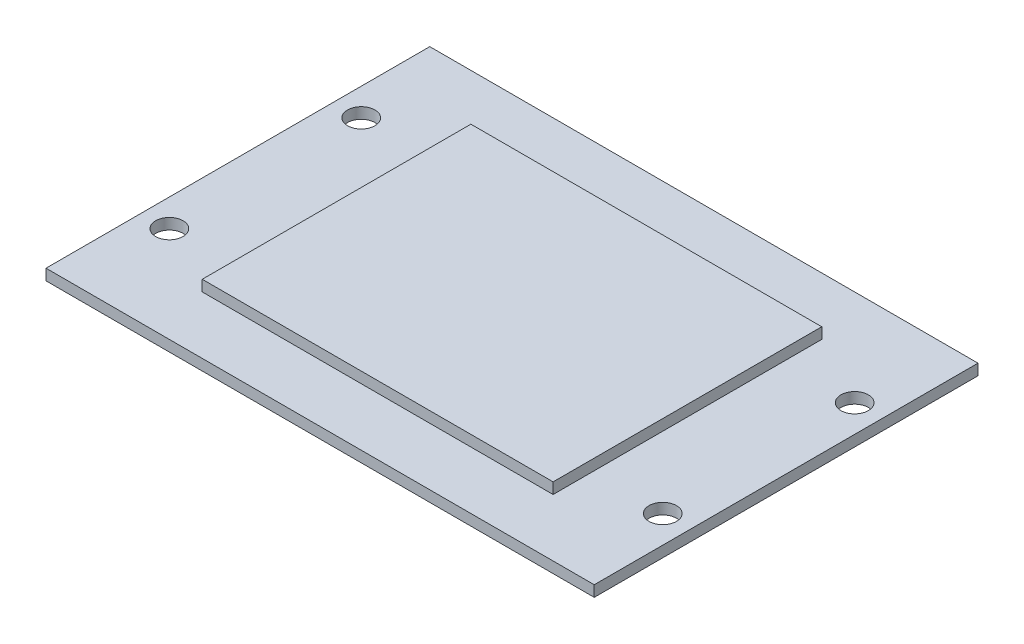
ISO-10303-21;
HEADER;
FILE_DESCRIPTION(('STEP AP214'),'2;1');
FILE_NAME('part.step','',(''),(''),'','','');
FILE_SCHEMA(('AUTOMOTIVE_DESIGN { 1 0 10303 214 1 1 1 1 }'));
ENDSEC;
DATA;
#1=APPLICATION_CONTEXT('core data for automotive mechanical design processes');
#2=APPLICATION_PROTOCOL_DEFINITION('international standard','automotive_design',2000,#1);
#3=PRODUCT_CONTEXT('',#1,'mechanical');
#4=PRODUCT('Part','Part','',(#3));
#5=PRODUCT_RELATED_PRODUCT_CATEGORY('part','',(#4));
#6=PRODUCT_DEFINITION_FORMATION('','',#4);
#7=PRODUCT_DEFINITION_CONTEXT('part definition',#1,'design');
#8=PRODUCT_DEFINITION('design','',#6,#7);
#9=PRODUCT_DEFINITION_SHAPE('','',#8);
#10=(LENGTH_UNIT() NAMED_UNIT(*) SI_UNIT(.MILLI.,.METRE.));
#11=(NAMED_UNIT(*) PLANE_ANGLE_UNIT() SI_UNIT($,.RADIAN.));
#12=(NAMED_UNIT(*) SI_UNIT($,.STERADIAN.) SOLID_ANGLE_UNIT());
#13=UNCERTAINTY_MEASURE_WITH_UNIT(LENGTH_MEASURE(1.E-05),#10,'distance_accuracy_value','');
#14=(GEOMETRIC_REPRESENTATION_CONTEXT(3) GLOBAL_UNCERTAINTY_ASSIGNED_CONTEXT((#13)) GLOBAL_UNIT_ASSIGNED_CONTEXT((#10,
#11,#12)) REPRESENTATION_CONTEXT('',''));
#15=CARTESIAN_POINT('',(0.,0.,0.));
#16=DIRECTION('',(0.,0.,1.));
#17=DIRECTION('',(1.,0.,0.));
#18=AXIS2_PLACEMENT_3D('',#15,#16,#17);
#19=CARTESIAN_POINT('',(0.,2.,0.));
#20=DIRECTION('',(0.,1.,0.));
#21=DIRECTION('',(0.,0.,1.));
#22=AXIS2_PLACEMENT_3D('',#19,#20,#21);
#23=PLANE('',#22);
#24=CARTESIAN_POINT('',(-42.132461783843,2.,27.4652027899469));
#25=DIRECTION('',(0.,1.,0.));
#26=DIRECTION('',(0.,0.,1.));
#27=AXIS2_PLACEMENT_3D('',#24,#25,#26);
#28=CIRCLE('',#27,2.5);
#29=CARTESIAN_POINT('',(-42.132461783843,2.,29.9652027899469));
#30=VERTEX_POINT('',#29);
#31=EDGE_CURVE('E220',#30,#30,#28,.T.);
#32=ORIENTED_EDGE('',*,*,#31,.F.);
#33=EDGE_LOOP('',(#32));
#34=FACE_BOUND('',#33,.T.);
#35=CARTESIAN_POINT('',(47.867538216157,2.,27.4652027899469));
#36=DIRECTION('',(0.,1.,0.));
#37=DIRECTION('',(0.,0.,1.));
#38=AXIS2_PLACEMENT_3D('',#35,#36,#37);
#39=CIRCLE('',#38,2.5);
#40=CARTESIAN_POINT('',(47.867538216157,2.,29.9652027899469));
#41=VERTEX_POINT('',#40);
#42=EDGE_CURVE('E222',#41,#41,#39,.T.);
#43=ORIENTED_EDGE('',*,*,#42,.F.);
#44=EDGE_LOOP('',(#43));
#45=FACE_BOUND('',#44,.T.);
#46=CARTESIAN_POINT('',(47.867538216157,2.,-7.53479721005307));
#47=DIRECTION('',(0.,1.,0.));
#48=DIRECTION('',(0.,0.,1.));
#49=AXIS2_PLACEMENT_3D('',#46,#47,#48);
#50=CIRCLE('',#49,2.5);
#51=CARTESIAN_POINT('',(47.867538216157,2.,-5.03479721005307));
#52=VERTEX_POINT('',#51);
#53=EDGE_CURVE('E228',#52,#52,#50,.T.);
#54=ORIENTED_EDGE('',*,*,#53,.F.);
#55=EDGE_LOOP('',(#54));
#56=FACE_BOUND('',#55,.T.);
#57=CARTESIAN_POINT('',(-42.132461783843,2.,-7.53479721005307));
#58=DIRECTION('',(0.,1.,0.));
#59=DIRECTION('',(0.,0.,1.));
#60=AXIS2_PLACEMENT_3D('',#57,#58,#59);
#61=CIRCLE('',#60,2.5);
#62=CARTESIAN_POINT('',(-42.132461783843,2.,-5.03479721005307));
#63=VERTEX_POINT('',#62);
#64=EDGE_CURVE('E234',#63,#63,#61,.T.);
#65=ORIENTED_EDGE('',*,*,#64,.F.);
#66=EDGE_LOOP('',(#65));
#67=FACE_BOUND('',#66,.T.);
#68=DIRECTION('',(0.,0.,1.));
#69=VECTOR('',#68,1.);
#70=CARTESIAN_POINT('',(-47.132461783843,2.,-25.0347972100531));
#71=LINE('',#70,#69);
#72=CARTESIAN_POINT('',(-47.132461783843,2.,-25.0347972100531));
#73=VERTEX_POINT('',#72);
#74=CARTESIAN_POINT('',(-47.132461783843,2.,44.9652027899469));
#75=VERTEX_POINT('',#74);
#76=EDGE_CURVE('E140',#73,#75,#71,.T.);
#77=ORIENTED_EDGE('',*,*,#76,.T.);
#78=DIRECTION('',(1.,0.,0.));
#79=VECTOR('',#78,1.);
#80=CARTESIAN_POINT('',(-47.132461783843,2.,44.9652027899469));
#81=LINE('',#80,#79);
#82=CARTESIAN_POINT('',(52.867538216157,2.,44.9652027899469));
#83=VERTEX_POINT('',#82);
#84=EDGE_CURVE('E85',#75,#83,#81,.T.);
#85=ORIENTED_EDGE('',*,*,#84,.T.);
#86=DIRECTION('',(0.,0.,-1.));
#87=VECTOR('',#86,1.);
#88=CARTESIAN_POINT('',(52.867538216157,2.,-25.0347972100531));
#89=LINE('',#88,#87);
#90=CARTESIAN_POINT('',(52.867538216157,2.,-25.0347972100531));
#91=VERTEX_POINT('',#90);
#92=EDGE_CURVE('E143',#83,#91,#89,.T.);
#93=ORIENTED_EDGE('',*,*,#92,.T.);
#94=DIRECTION('',(-1.,0.,0.));
#95=VECTOR('',#94,1.);
#96=CARTESIAN_POINT('',(-47.132461783843,2.,-25.0347972100531));
#97=LINE('',#96,#95);
#98=EDGE_CURVE('E57',#91,#73,#97,.T.);
#99=ORIENTED_EDGE('',*,*,#98,.T.);
#100=EDGE_LOOP('',(#77,#85,#93,#99));
#101=FACE_BOUND('',#100,.T.);
#102=DIRECTION('',(1.,0.,0.));
#103=VECTOR('',#102,1.);
#104=CARTESIAN_POINT('',(-29.132461783843,2.,34.4652027899469));
#105=LINE('',#104,#103);
#106=CARTESIAN_POINT('',(-29.132461783843,2.,34.4652027899469));
#107=VERTEX_POINT('',#106);
#108=CARTESIAN_POINT('',(34.867538216157,2.,34.4652027899469));
#109=VERTEX_POINT('',#108);
#110=EDGE_CURVE('E246',#107,#109,#105,.T.);
#111=ORIENTED_EDGE('',*,*,#110,.F.);
#112=DIRECTION('',(0.,0.,1.));
#113=VECTOR('',#112,1.);
#114=CARTESIAN_POINT('',(-29.132461783843,2.,34.4652027899469));
#115=LINE('',#114,#113);
#116=CARTESIAN_POINT('',(-29.132461783843,2.,-14.5347972100531));
#117=VERTEX_POINT('',#116);
#118=EDGE_CURVE('E130',#117,#107,#115,.T.);
#119=ORIENTED_EDGE('',*,*,#118,.F.);
#120=DIRECTION('',(-1.,0.,0.));
#121=VECTOR('',#120,1.);
#122=CARTESIAN_POINT('',(-29.132461783843,2.,-14.5347972100531));
#123=LINE('',#122,#121);
#124=CARTESIAN_POINT('',(34.867538216157,2.,-14.5347972100531));
#125=VERTEX_POINT('',#124);
#126=EDGE_CURVE('E126',#125,#117,#123,.T.);
#127=ORIENTED_EDGE('',*,*,#126,.F.);
#128=DIRECTION('',(0.,0.,-1.));
#129=VECTOR('',#128,1.);
#130=CARTESIAN_POINT('',(34.867538216157,2.,34.4652027899469));
#131=LINE('',#130,#129);
#132=EDGE_CURVE('E248',#109,#125,#131,.T.);
#133=ORIENTED_EDGE('',*,*,#132,.F.);
#134=EDGE_LOOP('',(#111,#119,#127,#133));
#135=FACE_BOUND('',#134,.T.);
#136=ADVANCED_FACE('F33',(#34,#45,#56,#67,#101,#135),#23,.T.);
#137=CARTESIAN_POINT('',(-47.132461783843,2.,-25.0347972100531));
#138=DIRECTION('',(1.,0.,0.));
#139=DIRECTION('',(0.,0.,-1.));
#140=AXIS2_PLACEMENT_3D('',#137,#138,#139);
#141=PLANE('',#140);
#142=DIRECTION('',(0.,0.,1.));
#143=VECTOR('',#142,1.);
#144=CARTESIAN_POINT('',(-47.132461783843,0.,-25.0347972100531));
#145=LINE('',#144,#143);
#146=CARTESIAN_POINT('',(-47.132461783843,0.,-25.0347972100531));
#147=VERTEX_POINT('',#146);
#148=CARTESIAN_POINT('',(-47.132461783843,0.,44.9652027899469));
#149=VERTEX_POINT('',#148);
#150=EDGE_CURVE('E132',#147,#149,#145,.T.);
#151=ORIENTED_EDGE('',*,*,#150,.T.);
#152=DIRECTION('',(0.,-1.,0.));
#153=VECTOR('',#152,1.);
#154=CARTESIAN_POINT('',(-47.132461783843,2.,44.9652027899469));
#155=LINE('',#154,#153);
#156=EDGE_CURVE('E11',#75,#149,#155,.T.);
#157=ORIENTED_EDGE('',*,*,#156,.F.);
#158=ORIENTED_EDGE('',*,*,#76,.F.);
#159=DIRECTION('',(0.,-1.,0.));
#160=VECTOR('',#159,1.);
#161=CARTESIAN_POINT('',(-47.132461783843,2.,-25.0347972100531));
#162=LINE('',#161,#160);
#163=EDGE_CURVE('E145',#73,#147,#162,.T.);
#164=ORIENTED_EDGE('',*,*,#163,.T.);
#165=EDGE_LOOP('',(#151,#157,#158,#164));
#166=FACE_BOUND('',#165,.T.);
#167=ADVANCED_FACE('F35',(#166),#141,.F.);
#168=CARTESIAN_POINT('',(-47.132461783843,2.,44.9652027899469));
#169=DIRECTION('',(0.,0.,-1.));
#170=DIRECTION('',(-1.,0.,0.));
#171=AXIS2_PLACEMENT_3D('',#168,#169,#170);
#172=PLANE('',#171);
#173=DIRECTION('',(1.,0.,0.));
#174=VECTOR('',#173,1.);
#175=CARTESIAN_POINT('',(-47.132461783843,0.,44.9652027899469));
#176=LINE('',#175,#174);
#177=CARTESIAN_POINT('',(52.867538216157,0.,44.9652027899469));
#178=VERTEX_POINT('',#177);
#179=EDGE_CURVE('E135',#149,#178,#176,.T.);
#180=ORIENTED_EDGE('',*,*,#179,.T.);
#181=DIRECTION('',(0.,-1.,0.));
#182=VECTOR('',#181,1.);
#183=CARTESIAN_POINT('',(52.867538216157,2.,44.9652027899469));
#184=LINE('',#183,#182);
#185=EDGE_CURVE('E41',#83,#178,#184,.T.);
#186=ORIENTED_EDGE('',*,*,#185,.F.);
#187=ORIENTED_EDGE('',*,*,#84,.F.);
#188=ORIENTED_EDGE('',*,*,#156,.T.);
#189=EDGE_LOOP('',(#180,#186,#187,#188));
#190=FACE_BOUND('',#189,.T.);
#191=ADVANCED_FACE('F174',(#190),#172,.F.);
#192=CARTESIAN_POINT('',(52.867538216157,2.,-25.0347972100531));
#193=DIRECTION('',(-1.,0.,0.));
#194=DIRECTION('',(0.,0.,1.));
#195=AXIS2_PLACEMENT_3D('',#192,#193,#194);
#196=PLANE('',#195);
#197=DIRECTION('',(0.,0.,-1.));
#198=VECTOR('',#197,1.);
#199=CARTESIAN_POINT('',(52.867538216157,0.,-25.0347972100531));
#200=LINE('',#199,#198);
#201=CARTESIAN_POINT('',(52.867538216157,0.,-25.0347972100531));
#202=VERTEX_POINT('',#201);
#203=EDGE_CURVE('E148',#178,#202,#200,.T.);
#204=ORIENTED_EDGE('',*,*,#203,.T.);
#205=DIRECTION('',(0.,-1.,0.));
#206=VECTOR('',#205,1.);
#207=CARTESIAN_POINT('',(52.867538216157,2.,-25.0347972100531));
#208=LINE('',#207,#206);
#209=EDGE_CURVE('E152',#91,#202,#208,.T.);
#210=ORIENTED_EDGE('',*,*,#209,.F.);
#211=ORIENTED_EDGE('',*,*,#92,.F.);
#212=ORIENTED_EDGE('',*,*,#185,.T.);
#213=EDGE_LOOP('',(#204,#210,#211,#212));
#214=FACE_BOUND('',#213,.T.);
#215=ADVANCED_FACE('F157',(#214),#196,.F.);
#216=CARTESIAN_POINT('',(-47.132461783843,2.,-25.0347972100531));
#217=DIRECTION('',(0.,0.,1.));
#218=DIRECTION('',(1.,0.,0.));
#219=AXIS2_PLACEMENT_3D('',#216,#217,#218);
#220=PLANE('',#219);
#221=DIRECTION('',(-1.,0.,0.));
#222=VECTOR('',#221,1.);
#223=CARTESIAN_POINT('',(-47.132461783843,0.,-25.0347972100531));
#224=LINE('',#223,#222);
#225=EDGE_CURVE('E78',#202,#147,#224,.T.);
#226=ORIENTED_EDGE('',*,*,#225,.T.);
#227=ORIENTED_EDGE('',*,*,#163,.F.);
#228=ORIENTED_EDGE('',*,*,#98,.F.);
#229=ORIENTED_EDGE('',*,*,#209,.T.);
#230=EDGE_LOOP('',(#226,#227,#228,#229));
#231=FACE_BOUND('',#230,.T.);
#232=ADVANCED_FACE('F165',(#231),#220,.F.);
#233=CARTESIAN_POINT('',(0.,0.,0.));
#234=DIRECTION('',(0.,1.,0.));
#235=DIRECTION('',(0.,0.,1.));
#236=AXIS2_PLACEMENT_3D('',#233,#234,#235);
#237=PLANE('',#236);
#238=CARTESIAN_POINT('',(-42.132461783843,0.,27.4652027899469));
#239=DIRECTION('',(0.,1.,0.));
#240=DIRECTION('',(0.,0.,1.));
#241=AXIS2_PLACEMENT_3D('',#238,#239,#240);
#242=CIRCLE('',#241,2.5);
#243=CARTESIAN_POINT('',(-42.132461783843,0.,29.9652027899469));
#244=VERTEX_POINT('',#243);
#245=EDGE_CURVE('E218',#244,#244,#242,.T.);
#246=ORIENTED_EDGE('',*,*,#245,.T.);
#247=EDGE_LOOP('',(#246));
#248=FACE_BOUND('',#247,.T.);
#249=CARTESIAN_POINT('',(47.867538216157,0.,27.4652027899469));
#250=DIRECTION('',(0.,1.,0.));
#251=DIRECTION('',(0.,0.,1.));
#252=AXIS2_PLACEMENT_3D('',#249,#250,#251);
#253=CIRCLE('',#252,2.5);
#254=CARTESIAN_POINT('',(47.867538216157,0.,29.9652027899469));
#255=VERTEX_POINT('',#254);
#256=EDGE_CURVE('E225',#255,#255,#253,.T.);
#257=ORIENTED_EDGE('',*,*,#256,.T.);
#258=EDGE_LOOP('',(#257));
#259=FACE_BOUND('',#258,.T.);
#260=CARTESIAN_POINT('',(47.867538216157,0.,-7.53479721005307));
#261=DIRECTION('',(0.,1.,0.));
#262=DIRECTION('',(0.,0.,1.));
#263=AXIS2_PLACEMENT_3D('',#260,#261,#262);
#264=CIRCLE('',#263,2.5);
#265=CARTESIAN_POINT('',(47.867538216157,0.,-5.03479721005307));
#266=VERTEX_POINT('',#265);
#267=EDGE_CURVE('E231',#266,#266,#264,.T.);
#268=ORIENTED_EDGE('',*,*,#267,.T.);
#269=EDGE_LOOP('',(#268));
#270=FACE_BOUND('',#269,.T.);
#271=CARTESIAN_POINT('',(-42.132461783843,0.,-7.53479721005307));
#272=DIRECTION('',(0.,1.,0.));
#273=DIRECTION('',(0.,0.,1.));
#274=AXIS2_PLACEMENT_3D('',#271,#272,#273);
#275=CIRCLE('',#274,2.5);
#276=CARTESIAN_POINT('',(-42.132461783843,0.,-5.03479721005307));
#277=VERTEX_POINT('',#276);
#278=EDGE_CURVE('E237',#277,#277,#275,.T.);
#279=ORIENTED_EDGE('',*,*,#278,.T.);
#280=EDGE_LOOP('',(#279));
#281=FACE_BOUND('',#280,.T.);
#282=ORIENTED_EDGE('',*,*,#150,.F.);
#283=ORIENTED_EDGE('',*,*,#225,.F.);
#284=ORIENTED_EDGE('',*,*,#203,.F.);
#285=ORIENTED_EDGE('',*,*,#179,.F.);
#286=EDGE_LOOP('',(#282,#283,#284,#285));
#287=FACE_BOUND('',#286,.T.);
#288=ADVANCED_FACE('F161',(#248,#259,#270,#281,#287),#237,.F.);
#289=CARTESIAN_POINT('',(-29.132461783843,4.,34.4652027899469));
#290=DIRECTION('',(1.,0.,0.));
#291=DIRECTION('',(0.,0.,-1.));
#292=AXIS2_PLACEMENT_3D('',#289,#290,#291);
#293=PLANE('',#292);
#294=ORIENTED_EDGE('',*,*,#118,.T.);
#295=DIRECTION('',(0.,-1.,0.));
#296=VECTOR('',#295,1.);
#297=CARTESIAN_POINT('',(-29.132461783843,4.,34.4652027899469));
#298=LINE('',#297,#296);
#299=CARTESIAN_POINT('',(-29.132461783843,4.,34.4652027899469));
#300=VERTEX_POINT('',#299);
#301=EDGE_CURVE('E111',#300,#107,#298,.T.);
#302=ORIENTED_EDGE('',*,*,#301,.F.);
#303=DIRECTION('',(0.,0.,1.));
#304=VECTOR('',#303,1.);
#305=CARTESIAN_POINT('',(-29.132461783843,4.,34.4652027899469));
#306=LINE('',#305,#304);
#307=CARTESIAN_POINT('',(-29.132461783843,4.,-14.5347972100531));
#308=VERTEX_POINT('',#307);
#309=EDGE_CURVE('E118',#308,#300,#306,.T.);
#310=ORIENTED_EDGE('',*,*,#309,.F.);
#311=DIRECTION('',(0.,-1.,0.));
#312=VECTOR('',#311,1.);
#313=CARTESIAN_POINT('',(-29.132461783843,4.,-14.5347972100531));
#314=LINE('',#313,#312);
#315=EDGE_CURVE('E244',#308,#117,#314,.T.);
#316=ORIENTED_EDGE('',*,*,#315,.T.);
#317=EDGE_LOOP('',(#294,#302,#310,#316));
#318=FACE_BOUND('',#317,.T.);
#319=ADVANCED_FACE('F128',(#318),#293,.F.);
#320=CARTESIAN_POINT('',(-29.132461783843,4.,34.4652027899469));
#321=DIRECTION('',(0.,0.,-1.));
#322=DIRECTION('',(-1.,0.,0.));
#323=AXIS2_PLACEMENT_3D('',#320,#321,#322);
#324=PLANE('',#323);
#325=ORIENTED_EDGE('',*,*,#110,.T.);
#326=DIRECTION('',(0.,-1.,0.));
#327=VECTOR('',#326,1.);
#328=CARTESIAN_POINT('',(34.867538216157,4.,34.4652027899469));
#329=LINE('',#328,#327);
#330=CARTESIAN_POINT('',(34.867538216157,4.,34.4652027899469));
#331=VERTEX_POINT('',#330);
#332=EDGE_CURVE('E114',#331,#109,#329,.T.);
#333=ORIENTED_EDGE('',*,*,#332,.F.);
#334=DIRECTION('',(1.,0.,0.));
#335=VECTOR('',#334,1.);
#336=CARTESIAN_POINT('',(-29.132461783843,4.,34.4652027899469));
#337=LINE('',#336,#335);
#338=EDGE_CURVE('E107',#300,#331,#337,.T.);
#339=ORIENTED_EDGE('',*,*,#338,.F.);
#340=ORIENTED_EDGE('',*,*,#301,.T.);
#341=EDGE_LOOP('',(#325,#333,#339,#340));
#342=FACE_BOUND('',#341,.T.);
#343=ADVANCED_FACE('F109',(#342),#324,.F.);
#344=CARTESIAN_POINT('',(34.867538216157,4.,34.4652027899469));
#345=DIRECTION('',(-1.,0.,0.));
#346=DIRECTION('',(0.,0.,1.));
#347=AXIS2_PLACEMENT_3D('',#344,#345,#346);
#348=PLANE('',#347);
#349=ORIENTED_EDGE('',*,*,#132,.T.);
#350=DIRECTION('',(0.,-1.,0.));
#351=VECTOR('',#350,1.);
#352=CARTESIAN_POINT('',(34.867538216157,4.,-14.5347972100531));
#353=LINE('',#352,#351);
#354=CARTESIAN_POINT('',(34.867538216157,4.,-14.5347972100531));
#355=VERTEX_POINT('',#354);
#356=EDGE_CURVE('E48',#355,#125,#353,.T.);
#357=ORIENTED_EDGE('',*,*,#356,.F.);
#358=DIRECTION('',(0.,0.,-1.));
#359=VECTOR('',#358,1.);
#360=CARTESIAN_POINT('',(34.867538216157,4.,34.4652027899469));
#361=LINE('',#360,#359);
#362=EDGE_CURVE('E117',#331,#355,#361,.T.);
#363=ORIENTED_EDGE('',*,*,#362,.F.);
#364=ORIENTED_EDGE('',*,*,#332,.T.);
#365=EDGE_LOOP('',(#349,#357,#363,#364));
#366=FACE_BOUND('',#365,.T.);
#367=ADVANCED_FACE('F189',(#366),#348,.F.);
#368=CARTESIAN_POINT('',(-29.132461783843,4.,-14.5347972100531));
#369=DIRECTION('',(0.,0.,1.));
#370=DIRECTION('',(1.,0.,0.));
#371=AXIS2_PLACEMENT_3D('',#368,#369,#370);
#372=PLANE('',#371);
#373=ORIENTED_EDGE('',*,*,#126,.T.);
#374=ORIENTED_EDGE('',*,*,#315,.F.);
#375=DIRECTION('',(-1.,0.,0.));
#376=VECTOR('',#375,1.);
#377=CARTESIAN_POINT('',(-29.132461783843,4.,-14.5347972100531));
#378=LINE('',#377,#376);
#379=EDGE_CURVE('E122',#355,#308,#378,.T.);
#380=ORIENTED_EDGE('',*,*,#379,.F.);
#381=ORIENTED_EDGE('',*,*,#356,.T.);
#382=EDGE_LOOP('',(#373,#374,#380,#381));
#383=FACE_BOUND('',#382,.T.);
#384=ADVANCED_FACE('F192',(#383),#372,.F.);
#385=CARTESIAN_POINT('',(0.,4.,0.));
#386=DIRECTION('',(0.,-1.,0.));
#387=DIRECTION('',(0.,0.,-1.));
#388=AXIS2_PLACEMENT_3D('',#385,#386,#387);
#389=PLANE('',#388);
#390=ORIENTED_EDGE('',*,*,#309,.T.);
#391=ORIENTED_EDGE('',*,*,#338,.T.);
#392=ORIENTED_EDGE('',*,*,#362,.T.);
#393=ORIENTED_EDGE('',*,*,#379,.T.);
#394=EDGE_LOOP('',(#390,#391,#392,#393));
#395=FACE_BOUND('',#394,.T.);
#396=ADVANCED_FACE('F121',(#395),#389,.F.);
#397=CARTESIAN_POINT('',(-42.132461783843,0.,-7.53479721005307));
#398=DIRECTION('',(0.,1.,0.));
#399=DIRECTION('',(0.,0.,1.));
#400=AXIS2_PLACEMENT_3D('',#397,#398,#399);
#401=CYLINDRICAL_SURFACE('',#400,2.5);
#402=ORIENTED_EDGE('',*,*,#278,.F.);
#403=EDGE_LOOP('',(#402));
#404=FACE_BOUND('',#403,.T.);
#405=ORIENTED_EDGE('',*,*,#64,.T.);
#406=EDGE_LOOP('',(#405));
#407=FACE_BOUND('',#406,.T.);
#408=ADVANCED_FACE('F198',(#404,#407),#401,.F.);
#409=CARTESIAN_POINT('',(47.867538216157,0.,-7.53479721005307));
#410=DIRECTION('',(0.,1.,0.));
#411=DIRECTION('',(0.,0.,1.));
#412=AXIS2_PLACEMENT_3D('',#409,#410,#411);
#413=CYLINDRICAL_SURFACE('',#412,2.5);
#414=ORIENTED_EDGE('',*,*,#267,.F.);
#415=EDGE_LOOP('',(#414));
#416=FACE_BOUND('',#415,.T.);
#417=ORIENTED_EDGE('',*,*,#53,.T.);
#418=EDGE_LOOP('',(#417));
#419=FACE_BOUND('',#418,.T.);
#420=ADVANCED_FACE('F201',(#416,#419),#413,.F.);
#421=CARTESIAN_POINT('',(47.867538216157,0.,27.4652027899469));
#422=DIRECTION('',(0.,1.,0.));
#423=DIRECTION('',(0.,0.,1.));
#424=AXIS2_PLACEMENT_3D('',#421,#422,#423);
#425=CYLINDRICAL_SURFACE('',#424,2.5);
#426=ORIENTED_EDGE('',*,*,#256,.F.);
#427=EDGE_LOOP('',(#426));
#428=FACE_BOUND('',#427,.T.);
#429=ORIENTED_EDGE('',*,*,#42,.T.);
#430=EDGE_LOOP('',(#429));
#431=FACE_BOUND('',#430,.T.);
#432=ADVANCED_FACE('F205',(#428,#431),#425,.F.);
#433=CARTESIAN_POINT('',(-42.132461783843,0.,27.4652027899469));
#434=DIRECTION('',(0.,1.,0.));
#435=DIRECTION('',(0.,0.,1.));
#436=AXIS2_PLACEMENT_3D('',#433,#434,#435);
#437=CYLINDRICAL_SURFACE('',#436,2.5);
#438=ORIENTED_EDGE('',*,*,#245,.F.);
#439=EDGE_LOOP('',(#438));
#440=FACE_BOUND('',#439,.T.);
#441=ORIENTED_EDGE('',*,*,#31,.T.);
#442=EDGE_LOOP('',(#441));
#443=FACE_BOUND('',#442,.T.);
#444=ADVANCED_FACE('F209',(#440,#443),#437,.F.);
#445=CLOSED_SHELL('',(#136,#167,#191,#215,#232,#288,#319,#343,#367,#384,#396,#408,#420,#432,#444));
#446=MANIFOLD_SOLID_BREP('B2',#445);
#447=ADVANCED_BREP_SHAPE_REPRESENTATION('',(#18,#446),#14);
#448=SHAPE_DEFINITION_REPRESENTATION(#9,#447);
ENDSEC;
END-ISO-10303-21;
